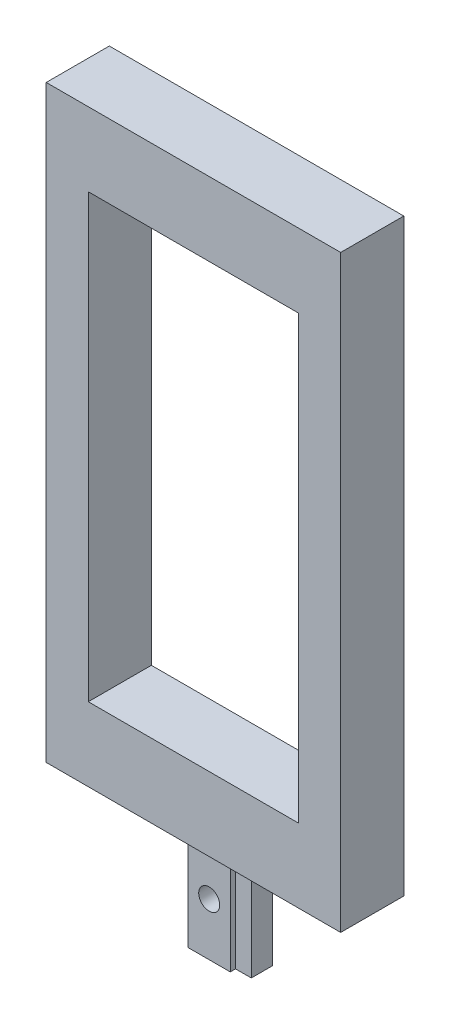
ISO-10303-21;
HEADER;
FILE_DESCRIPTION(('STEP AP214'),'2;1');
FILE_NAME('part.step','',(''),(''),'','','');
FILE_SCHEMA(('AUTOMOTIVE_DESIGN { 1 0 10303 214 1 1 1 1 }'));
ENDSEC;
DATA;
#1=APPLICATION_CONTEXT('core data for automotive mechanical design processes');
#2=APPLICATION_PROTOCOL_DEFINITION('international standard','automotive_design',2000,#1);
#3=PRODUCT_CONTEXT('',#1,'mechanical');
#4=PRODUCT('Part','Part','',(#3));
#5=PRODUCT_RELATED_PRODUCT_CATEGORY('part','',(#4));
#6=PRODUCT_DEFINITION_FORMATION('','',#4);
#7=PRODUCT_DEFINITION_CONTEXT('part definition',#1,'design');
#8=PRODUCT_DEFINITION('design','',#6,#7);
#9=PRODUCT_DEFINITION_SHAPE('','',#8);
#10=(LENGTH_UNIT() NAMED_UNIT(*) SI_UNIT(.MILLI.,.METRE.));
#11=(NAMED_UNIT(*) PLANE_ANGLE_UNIT() SI_UNIT($,.RADIAN.));
#12=(NAMED_UNIT(*) SI_UNIT($,.STERADIAN.) SOLID_ANGLE_UNIT());
#13=UNCERTAINTY_MEASURE_WITH_UNIT(LENGTH_MEASURE(1.E-05),#10,'distance_accuracy_value','');
#14=(GEOMETRIC_REPRESENTATION_CONTEXT(3) GLOBAL_UNCERTAINTY_ASSIGNED_CONTEXT((#13)) GLOBAL_UNIT_ASSIGNED_CONTEXT((#10,
#11,#12)) REPRESENTATION_CONTEXT('',''));
#15=CARTESIAN_POINT('',(0.,0.,0.));
#16=DIRECTION('',(0.,0.,1.));
#17=DIRECTION('',(1.,0.,0.));
#18=AXIS2_PLACEMENT_3D('',#15,#16,#17);
#19=CARTESIAN_POINT('',(-14.,-28.,6.));
#20=DIRECTION('',(0.,1.,0.));
#21=DIRECTION('',(0.,0.,1.));
#22=AXIS2_PLACEMENT_3D('',#19,#20,#21);
#23=PLANE('',#22);
#24=DIRECTION('',(1.,0.,0.));
#25=VECTOR('',#24,1.);
#26=CARTESIAN_POINT('',(-14.,-28.,0.));
#27=LINE('',#26,#25);
#28=CARTESIAN_POINT('',(-14.,-28.,0.));
#29=VERTEX_POINT('',#28);
#30=CARTESIAN_POINT('',(14.,-28.,0.));
#31=VERTEX_POINT('',#30);
#32=EDGE_CURVE('E235',#29,#31,#27,.T.);
#33=ORIENTED_EDGE('',*,*,#32,.T.);
#34=DIRECTION('',(0.,0.,-1.));
#35=VECTOR('',#34,1.);
#36=CARTESIAN_POINT('',(14.,-28.,6.));
#37=LINE('',#36,#35);
#38=CARTESIAN_POINT('',(14.,-28.,6.));
#39=VERTEX_POINT('',#38);
#40=EDGE_CURVE('E244',#39,#31,#37,.T.);
#41=ORIENTED_EDGE('',*,*,#40,.F.);
#42=DIRECTION('',(1.,0.,0.));
#43=VECTOR('',#42,1.);
#44=CARTESIAN_POINT('',(-14.,-28.,6.));
#45=LINE('',#44,#43);
#46=CARTESIAN_POINT('',(-14.,-28.,6.));
#47=VERTEX_POINT('',#46);
#48=EDGE_CURVE('E241',#47,#39,#45,.T.);
#49=ORIENTED_EDGE('',*,*,#48,.F.);
#50=DIRECTION('',(0.,0.,-1.));
#51=VECTOR('',#50,1.);
#52=CARTESIAN_POINT('',(-14.,-28.,6.));
#53=LINE('',#52,#51);
#54=EDGE_CURVE('E259',#47,#29,#53,.T.);
#55=ORIENTED_EDGE('',*,*,#54,.T.);
#56=EDGE_LOOP('',(#33,#41,#49,#55));
#57=FACE_BOUND('',#56,.T.);
#58=DIRECTION('',(1.,0.,0.));
#59=VECTOR('',#58,1.);
#60=CARTESIAN_POINT('',(0.,-28.,1.5));
#61=LINE('',#60,#59);
#62=CARTESIAN_POINT('',(-2.,-28.,1.5));
#63=VERTEX_POINT('',#62);
#64=CARTESIAN_POINT('',(2.,-28.,1.5));
#65=VERTEX_POINT('',#64);
#66=EDGE_CURVE('E57',#63,#65,#61,.T.);
#67=ORIENTED_EDGE('',*,*,#66,.F.);
#68=DIRECTION('',(0.,0.,1.));
#69=VECTOR('',#68,1.);
#70=CARTESIAN_POINT('',(-2.,-28.,0.));
#71=LINE('',#70,#69);
#72=CARTESIAN_POINT('',(-2.,-28.,4.5));
#73=VERTEX_POINT('',#72);
#74=EDGE_CURVE('E62',#63,#73,#71,.T.);
#75=ORIENTED_EDGE('',*,*,#74,.T.);
#76=DIRECTION('',(1.,0.,0.));
#77=VECTOR('',#76,1.);
#78=CARTESIAN_POINT('',(0.,-28.,4.5));
#79=LINE('',#78,#77);
#80=CARTESIAN_POINT('',(2.,-28.,4.5));
#81=VERTEX_POINT('',#80);
#82=EDGE_CURVE('E398',#73,#81,#79,.T.);
#83=ORIENTED_EDGE('',*,*,#82,.T.);
#84=DIRECTION('',(0.,0.,1.));
#85=VECTOR('',#84,1.);
#86=CARTESIAN_POINT('',(2.,-28.,0.));
#87=LINE('',#86,#85);
#88=CARTESIAN_POINT('',(2.,-28.,4.));
#89=VERTEX_POINT('',#88);
#90=EDGE_CURVE('E387',#89,#81,#87,.T.);
#91=ORIENTED_EDGE('',*,*,#90,.F.);
#92=DIRECTION('',(1.,0.,0.));
#93=VECTOR('',#92,1.);
#94=CARTESIAN_POINT('',(0.,-28.,4.));
#95=LINE('',#94,#93);
#96=CARTESIAN_POINT('',(3.5,-28.,4.));
#97=VERTEX_POINT('',#96);
#98=EDGE_CURVE('E395',#89,#97,#95,.T.);
#99=ORIENTED_EDGE('',*,*,#98,.T.);
#100=DIRECTION('',(0.,0.,1.));
#101=VECTOR('',#100,1.);
#102=CARTESIAN_POINT('',(3.5,-28.,0.));
#103=LINE('',#102,#101);
#104=CARTESIAN_POINT('',(3.5,-28.,2.));
#105=VERTEX_POINT('',#104);
#106=EDGE_CURVE('E391',#105,#97,#103,.T.);
#107=ORIENTED_EDGE('',*,*,#106,.F.);
#108=DIRECTION('',(1.,0.,0.));
#109=VECTOR('',#108,1.);
#110=CARTESIAN_POINT('',(0.,-28.,2.));
#111=LINE('',#110,#109);
#112=CARTESIAN_POINT('',(2.,-28.,2.));
#113=VERTEX_POINT('',#112);
#114=EDGE_CURVE('E386',#113,#105,#111,.T.);
#115=ORIENTED_EDGE('',*,*,#114,.F.);
#116=EDGE_CURVE('E364',#65,#113,#87,.T.);
#117=ORIENTED_EDGE('',*,*,#116,.F.);
#118=EDGE_LOOP('',(#67,#75,#83,#91,#99,#107,#115,#117));
#119=FACE_BOUND('',#118,.T.);
#120=ADVANCED_FACE('F41',(#57,#119),#23,.F.);
#121=CARTESIAN_POINT('',(0.,0.,6.));
#122=DIRECTION('',(0.,0.,-1.));
#123=DIRECTION('',(-1.,0.,0.));
#124=AXIS2_PLACEMENT_3D('',#121,#122,#123);
#125=PLANE('',#124);
#126=DIRECTION('',(0.,1.,0.));
#127=VECTOR('',#126,1.);
#128=CARTESIAN_POINT('',(14.,-28.,6.));
#129=LINE('',#128,#127);
#130=CARTESIAN_POINT('',(14.,28.,6.));
#131=VERTEX_POINT('',#130);
#132=EDGE_CURVE('E230',#39,#131,#129,.T.);
#133=ORIENTED_EDGE('',*,*,#132,.T.);
#134=DIRECTION('',(-1.,0.,0.));
#135=VECTOR('',#134,1.);
#136=CARTESIAN_POINT('',(-14.,28.,6.));
#137=LINE('',#136,#135);
#138=CARTESIAN_POINT('',(-14.,28.,6.));
#139=VERTEX_POINT('',#138);
#140=EDGE_CURVE('E234',#131,#139,#137,.T.);
#141=ORIENTED_EDGE('',*,*,#140,.T.);
#142=DIRECTION('',(0.,-1.,0.));
#143=VECTOR('',#142,1.);
#144=CARTESIAN_POINT('',(-14.,-28.,6.));
#145=LINE('',#144,#143);
#146=EDGE_CURVE('E238',#139,#47,#145,.T.);
#147=ORIENTED_EDGE('',*,*,#146,.T.);
#148=ORIENTED_EDGE('',*,*,#48,.T.);
#149=EDGE_LOOP('',(#133,#141,#147,#148));
#150=FACE_BOUND('',#149,.T.);
#151=DIRECTION('',(0.,1.,0.));
#152=VECTOR('',#151,1.);
#153=CARTESIAN_POINT('',(10.,-21.,6.));
#154=LINE('',#153,#152);
#155=CARTESIAN_POINT('',(10.,-21.,6.));
#156=VERTEX_POINT('',#155);
#157=CARTESIAN_POINT('',(10.,21.,6.));
#158=VERTEX_POINT('',#157);
#159=EDGE_CURVE('E191',#156,#158,#154,.T.);
#160=ORIENTED_EDGE('',*,*,#159,.F.);
#161=DIRECTION('',(1.,0.,0.));
#162=VECTOR('',#161,1.);
#163=CARTESIAN_POINT('',(-10.,-21.,6.));
#164=LINE('',#163,#162);
#165=CARTESIAN_POINT('',(-10.,-21.,6.));
#166=VERTEX_POINT('',#165);
#167=EDGE_CURVE('E202',#166,#156,#164,.T.);
#168=ORIENTED_EDGE('',*,*,#167,.F.);
#169=DIRECTION('',(0.,-1.,0.));
#170=VECTOR('',#169,1.);
#171=CARTESIAN_POINT('',(-10.,-21.,6.));
#172=LINE('',#171,#170);
#173=CARTESIAN_POINT('',(-10.,21.,6.));
#174=VERTEX_POINT('',#173);
#175=EDGE_CURVE('E198',#174,#166,#172,.T.);
#176=ORIENTED_EDGE('',*,*,#175,.F.);
#177=DIRECTION('',(-1.,0.,0.));
#178=VECTOR('',#177,1.);
#179=CARTESIAN_POINT('',(-10.,21.,6.));
#180=LINE('',#179,#178);
#181=EDGE_CURVE('E194',#158,#174,#180,.T.);
#182=ORIENTED_EDGE('',*,*,#181,.F.);
#183=EDGE_LOOP('',(#160,#168,#176,#182));
#184=FACE_BOUND('',#183,.T.);
#185=ADVANCED_FACE('F283',(#150,#184),#125,.F.);
#186=CARTESIAN_POINT('',(0.,0.,0.));
#187=DIRECTION('',(0.,0.,-1.));
#188=DIRECTION('',(-1.,0.,0.));
#189=AXIS2_PLACEMENT_3D('',#186,#187,#188);
#190=PLANE('',#189);
#191=DIRECTION('',(0.,1.,0.));
#192=VECTOR('',#191,1.);
#193=CARTESIAN_POINT('',(14.,-28.,0.));
#194=LINE('',#193,#192);
#195=CARTESIAN_POINT('',(14.,28.,0.));
#196=VERTEX_POINT('',#195);
#197=EDGE_CURVE('E229',#31,#196,#194,.T.);
#198=ORIENTED_EDGE('',*,*,#197,.F.);
#199=ORIENTED_EDGE('',*,*,#32,.F.);
#200=DIRECTION('',(0.,-1.,0.));
#201=VECTOR('',#200,1.);
#202=CARTESIAN_POINT('',(-14.,-28.,0.));
#203=LINE('',#202,#201);
#204=CARTESIAN_POINT('',(-14.,28.,0.));
#205=VERTEX_POINT('',#204);
#206=EDGE_CURVE('E251',#205,#29,#203,.T.);
#207=ORIENTED_EDGE('',*,*,#206,.F.);
#208=DIRECTION('',(-1.,0.,0.));
#209=VECTOR('',#208,1.);
#210=CARTESIAN_POINT('',(-14.,28.,0.));
#211=LINE('',#210,#209);
#212=EDGE_CURVE('E248',#196,#205,#211,.T.);
#213=ORIENTED_EDGE('',*,*,#212,.F.);
#214=EDGE_LOOP('',(#198,#199,#207,#213));
#215=FACE_BOUND('',#214,.T.);
#216=DIRECTION('',(1.,0.,0.));
#217=VECTOR('',#216,1.);
#218=CARTESIAN_POINT('',(-10.,-21.,0.));
#219=LINE('',#218,#217);
#220=CARTESIAN_POINT('',(-10.,-21.,0.));
#221=VERTEX_POINT('',#220);
#222=CARTESIAN_POINT('',(10.,-21.,0.));
#223=VERTEX_POINT('',#222);
#224=EDGE_CURVE('E195',#221,#223,#219,.T.);
#225=ORIENTED_EDGE('',*,*,#224,.T.);
#226=DIRECTION('',(0.,1.,0.));
#227=VECTOR('',#226,1.);
#228=CARTESIAN_POINT('',(10.,-21.,0.));
#229=LINE('',#228,#227);
#230=CARTESIAN_POINT('',(10.,21.,0.));
#231=VERTEX_POINT('',#230);
#232=EDGE_CURVE('E180',#223,#231,#229,.T.);
#233=ORIENTED_EDGE('',*,*,#232,.T.);
#234=DIRECTION('',(-1.,0.,0.));
#235=VECTOR('',#234,1.);
#236=CARTESIAN_POINT('',(-10.,21.,0.));
#237=LINE('',#236,#235);
#238=CARTESIAN_POINT('',(-10.,21.,0.));
#239=VERTEX_POINT('',#238);
#240=EDGE_CURVE('E185',#231,#239,#237,.T.);
#241=ORIENTED_EDGE('',*,*,#240,.T.);
#242=DIRECTION('',(0.,-1.,0.));
#243=VECTOR('',#242,1.);
#244=CARTESIAN_POINT('',(-10.,-21.,0.));
#245=LINE('',#244,#243);
#246=EDGE_CURVE('E209',#239,#221,#245,.T.);
#247=ORIENTED_EDGE('',*,*,#246,.T.);
#248=EDGE_LOOP('',(#225,#233,#241,#247));
#249=FACE_BOUND('',#248,.T.);
#250=ADVANCED_FACE('F274',(#215,#249),#190,.T.);
#251=CARTESIAN_POINT('',(14.,-28.,6.));
#252=DIRECTION('',(-1.,0.,0.));
#253=DIRECTION('',(0.,0.,1.));
#254=AXIS2_PLACEMENT_3D('',#251,#252,#253);
#255=PLANE('',#254);
#256=ORIENTED_EDGE('',*,*,#197,.T.);
#257=DIRECTION('',(0.,0.,-1.));
#258=VECTOR('',#257,1.);
#259=CARTESIAN_POINT('',(14.,28.,6.));
#260=LINE('',#259,#258);
#261=EDGE_CURVE('E11',#131,#196,#260,.T.);
#262=ORIENTED_EDGE('',*,*,#261,.F.);
#263=ORIENTED_EDGE('',*,*,#132,.F.);
#264=ORIENTED_EDGE('',*,*,#40,.T.);
#265=EDGE_LOOP('',(#256,#262,#263,#264));
#266=FACE_BOUND('',#265,.T.);
#267=ADVANCED_FACE('F43',(#266),#255,.F.);
#268=CARTESIAN_POINT('',(-14.,28.,6.));
#269=DIRECTION('',(0.,-1.,0.));
#270=DIRECTION('',(0.,0.,-1.));
#271=AXIS2_PLACEMENT_3D('',#268,#269,#270);
#272=PLANE('',#271);
#273=ORIENTED_EDGE('',*,*,#212,.T.);
#274=DIRECTION('',(0.,0.,-1.));
#275=VECTOR('',#274,1.);
#276=CARTESIAN_POINT('',(-14.,28.,6.));
#277=LINE('',#276,#275);
#278=EDGE_CURVE('E50',#139,#205,#277,.T.);
#279=ORIENTED_EDGE('',*,*,#278,.F.);
#280=ORIENTED_EDGE('',*,*,#140,.F.);
#281=ORIENTED_EDGE('',*,*,#261,.T.);
#282=EDGE_LOOP('',(#273,#279,#280,#281));
#283=FACE_BOUND('',#282,.T.);
#284=ADVANCED_FACE('F285',(#283),#272,.F.);
#285=CARTESIAN_POINT('',(-14.,-28.,6.));
#286=DIRECTION('',(1.,0.,0.));
#287=DIRECTION('',(0.,0.,-1.));
#288=AXIS2_PLACEMENT_3D('',#285,#286,#287);
#289=PLANE('',#288);
#290=ORIENTED_EDGE('',*,*,#206,.T.);
#291=ORIENTED_EDGE('',*,*,#54,.F.);
#292=ORIENTED_EDGE('',*,*,#146,.F.);
#293=ORIENTED_EDGE('',*,*,#278,.T.);
#294=EDGE_LOOP('',(#290,#291,#292,#293));
#295=FACE_BOUND('',#294,.T.);
#296=ADVANCED_FACE('F268',(#295),#289,.F.);
#297=CARTESIAN_POINT('',(10.,-21.,6.));
#298=DIRECTION('',(-1.,0.,0.));
#299=DIRECTION('',(0.,0.,1.));
#300=AXIS2_PLACEMENT_3D('',#297,#298,#299);
#301=PLANE('',#300);
#302=ORIENTED_EDGE('',*,*,#232,.F.);
#303=DIRECTION('',(0.,0.,-1.));
#304=VECTOR('',#303,1.);
#305=CARTESIAN_POINT('',(10.,-21.,6.));
#306=LINE('',#305,#304);
#307=EDGE_CURVE('E204',#156,#223,#306,.T.);
#308=ORIENTED_EDGE('',*,*,#307,.F.);
#309=ORIENTED_EDGE('',*,*,#159,.T.);
#310=DIRECTION('',(0.,0.,-1.));
#311=VECTOR('',#310,1.);
#312=CARTESIAN_POINT('',(10.,21.,6.));
#313=LINE('',#312,#311);
#314=EDGE_CURVE('E225',#158,#231,#313,.T.);
#315=ORIENTED_EDGE('',*,*,#314,.T.);
#316=EDGE_LOOP('',(#302,#308,#309,#315));
#317=FACE_BOUND('',#316,.T.);
#318=ADVANCED_FACE('F291',(#317),#301,.T.);
#319=CARTESIAN_POINT('',(-10.,21.,6.));
#320=DIRECTION('',(0.,-1.,0.));
#321=DIRECTION('',(0.,0.,-1.));
#322=AXIS2_PLACEMENT_3D('',#319,#320,#321);
#323=PLANE('',#322);
#324=ORIENTED_EDGE('',*,*,#240,.F.);
#325=ORIENTED_EDGE('',*,*,#314,.F.);
#326=ORIENTED_EDGE('',*,*,#181,.T.);
#327=DIRECTION('',(0.,0.,-1.));
#328=VECTOR('',#327,1.);
#329=CARTESIAN_POINT('',(-10.,21.,6.));
#330=LINE('',#329,#328);
#331=EDGE_CURVE('E222',#174,#239,#330,.T.);
#332=ORIENTED_EDGE('',*,*,#331,.T.);
#333=EDGE_LOOP('',(#324,#325,#326,#332));
#334=FACE_BOUND('',#333,.T.);
#335=ADVANCED_FACE('F306',(#334),#323,.T.);
#336=CARTESIAN_POINT('',(-10.,-21.,6.));
#337=DIRECTION('',(1.,0.,0.));
#338=DIRECTION('',(0.,0.,-1.));
#339=AXIS2_PLACEMENT_3D('',#336,#337,#338);
#340=PLANE('',#339);
#341=ORIENTED_EDGE('',*,*,#246,.F.);
#342=ORIENTED_EDGE('',*,*,#331,.F.);
#343=ORIENTED_EDGE('',*,*,#175,.T.);
#344=DIRECTION('',(0.,0.,-1.));
#345=VECTOR('',#344,1.);
#346=CARTESIAN_POINT('',(-10.,-21.,6.));
#347=LINE('',#346,#345);
#348=EDGE_CURVE('E219',#166,#221,#347,.T.);
#349=ORIENTED_EDGE('',*,*,#348,.T.);
#350=EDGE_LOOP('',(#341,#342,#343,#349));
#351=FACE_BOUND('',#350,.T.);
#352=ADVANCED_FACE('F310',(#351),#340,.T.);
#353=CARTESIAN_POINT('',(-10.,-21.,6.));
#354=DIRECTION('',(0.,1.,0.));
#355=DIRECTION('',(0.,0.,1.));
#356=AXIS2_PLACEMENT_3D('',#353,#354,#355);
#357=PLANE('',#356);
#358=ORIENTED_EDGE('',*,*,#224,.F.);
#359=ORIENTED_EDGE('',*,*,#348,.F.);
#360=ORIENTED_EDGE('',*,*,#167,.T.);
#361=ORIENTED_EDGE('',*,*,#307,.T.);
#362=EDGE_LOOP('',(#358,#359,#360,#361));
#363=FACE_BOUND('',#362,.T.);
#364=ADVANCED_FACE('F314',(#363),#357,.T.);
#365=CARTESIAN_POINT('',(0.,-38.,1.5));
#366=DIRECTION('',(0.,0.,1.));
#367=DIRECTION('',(1.,0.,0.));
#368=AXIS2_PLACEMENT_3D('',#365,#366,#367);
#369=PLANE('',#368);
#370=CARTESIAN_POINT('',(0.,-33.,1.5));
#371=DIRECTION('',(0.,0.,1.));
#372=DIRECTION('',(1.,0.,0.));
#373=AXIS2_PLACEMENT_3D('',#370,#371,#372);
#374=CIRCLE('',#373,1.);
#375=CARTESIAN_POINT('',(1.,-33.,1.5));
#376=VERTEX_POINT('',#375);
#377=EDGE_CURVE('E359',#376,#376,#374,.T.);
#378=ORIENTED_EDGE('',*,*,#377,.T.);
#379=EDGE_LOOP('',(#378));
#380=FACE_BOUND('',#379,.T.);
#381=ORIENTED_EDGE('',*,*,#66,.T.);
#382=DIRECTION('',(0.,1.,0.));
#383=VECTOR('',#382,1.);
#384=CARTESIAN_POINT('',(2.,-38.,1.5));
#385=LINE('',#384,#383);
#386=CARTESIAN_POINT('',(2.,-38.,1.5));
#387=VERTEX_POINT('',#386);
#388=EDGE_CURVE('E159',#387,#65,#385,.T.);
#389=ORIENTED_EDGE('',*,*,#388,.F.);
#390=DIRECTION('',(1.,0.,0.));
#391=VECTOR('',#390,1.);
#392=CARTESIAN_POINT('',(0.,-38.,1.5));
#393=LINE('',#392,#391);
#394=CARTESIAN_POINT('',(-2.,-38.,1.5));
#395=VERTEX_POINT('',#394);
#396=EDGE_CURVE('E166',#395,#387,#393,.T.);
#397=ORIENTED_EDGE('',*,*,#396,.F.);
#398=DIRECTION('',(0.,1.,0.));
#399=VECTOR('',#398,1.);
#400=CARTESIAN_POINT('',(-2.,-38.,1.5));
#401=LINE('',#400,#399);
#402=EDGE_CURVE('E382',#395,#63,#401,.T.);
#403=ORIENTED_EDGE('',*,*,#402,.T.);
#404=EDGE_LOOP('',(#381,#389,#397,#403));
#405=FACE_BOUND('',#404,.T.);
#406=ADVANCED_FACE('F178',(#380,#405),#369,.F.);
#407=CARTESIAN_POINT('',(2.,-38.,0.));
#408=DIRECTION('',(-1.,0.,0.));
#409=DIRECTION('',(0.,0.,1.));
#410=AXIS2_PLACEMENT_3D('',#407,#408,#409);
#411=PLANE('',#410);
#412=ORIENTED_EDGE('',*,*,#116,.T.);
#413=DIRECTION('',(0.,1.,0.));
#414=VECTOR('',#413,1.);
#415=CARTESIAN_POINT('',(2.,-38.,2.));
#416=LINE('',#415,#414);
#417=CARTESIAN_POINT('',(2.,-38.,2.));
#418=VERTEX_POINT('',#417);
#419=EDGE_CURVE('E161',#418,#113,#416,.T.);
#420=ORIENTED_EDGE('',*,*,#419,.F.);
#421=DIRECTION('',(0.,0.,1.));
#422=VECTOR('',#421,1.);
#423=CARTESIAN_POINT('',(2.,-38.,0.));
#424=LINE('',#423,#422);
#425=EDGE_CURVE('E154',#387,#418,#424,.T.);
#426=ORIENTED_EDGE('',*,*,#425,.F.);
#427=ORIENTED_EDGE('',*,*,#388,.T.);
#428=EDGE_LOOP('',(#412,#420,#426,#427));
#429=FACE_BOUND('',#428,.T.);
#430=ADVANCED_FACE('F157',(#429),#411,.F.);
#431=CARTESIAN_POINT('',(0.,-38.,2.));
#432=DIRECTION('',(0.,0.,1.));
#433=DIRECTION('',(1.,0.,0.));
#434=AXIS2_PLACEMENT_3D('',#431,#432,#433);
#435=PLANE('',#434);
#436=ORIENTED_EDGE('',*,*,#114,.T.);
#437=DIRECTION('',(0.,1.,0.));
#438=VECTOR('',#437,1.);
#439=CARTESIAN_POINT('',(3.5,-38.,2.));
#440=LINE('',#439,#438);
#441=CARTESIAN_POINT('',(3.5,-38.,2.));
#442=VERTEX_POINT('',#441);
#443=EDGE_CURVE('E187',#442,#105,#440,.T.);
#444=ORIENTED_EDGE('',*,*,#443,.F.);
#445=DIRECTION('',(1.,0.,0.));
#446=VECTOR('',#445,1.);
#447=CARTESIAN_POINT('',(0.,-38.,2.));
#448=LINE('',#447,#446);
#449=EDGE_CURVE('E165',#418,#442,#448,.T.);
#450=ORIENTED_EDGE('',*,*,#449,.F.);
#451=ORIENTED_EDGE('',*,*,#419,.T.);
#452=EDGE_LOOP('',(#436,#444,#450,#451));
#453=FACE_BOUND('',#452,.T.);
#454=ADVANCED_FACE('F322',(#453),#435,.F.);
#455=CARTESIAN_POINT('',(3.5,-38.,0.));
#456=DIRECTION('',(-1.,0.,0.));
#457=DIRECTION('',(0.,0.,1.));
#458=AXIS2_PLACEMENT_3D('',#455,#456,#457);
#459=PLANE('',#458);
#460=ORIENTED_EDGE('',*,*,#106,.T.);
#461=DIRECTION('',(0.,1.,0.));
#462=VECTOR('',#461,1.);
#463=CARTESIAN_POINT('',(3.5,-38.,4.));
#464=LINE('',#463,#462);
#465=CARTESIAN_POINT('',(3.5,-38.,4.));
#466=VERTEX_POINT('',#465);
#467=EDGE_CURVE('E416',#466,#97,#464,.T.);
#468=ORIENTED_EDGE('',*,*,#467,.F.);
#469=DIRECTION('',(0.,0.,1.));
#470=VECTOR('',#469,1.);
#471=CARTESIAN_POINT('',(3.5,-38.,0.));
#472=LINE('',#471,#470);
#473=EDGE_CURVE('E370',#442,#466,#472,.T.);
#474=ORIENTED_EDGE('',*,*,#473,.F.);
#475=ORIENTED_EDGE('',*,*,#443,.T.);
#476=EDGE_LOOP('',(#460,#468,#474,#475));
#477=FACE_BOUND('',#476,.T.);
#478=ADVANCED_FACE('F325',(#477),#459,.F.);
#479=CARTESIAN_POINT('',(0.,-38.,4.));
#480=DIRECTION('',(0.,0.,1.));
#481=DIRECTION('',(1.,0.,0.));
#482=AXIS2_PLACEMENT_3D('',#479,#480,#481);
#483=PLANE('',#482);
#484=ORIENTED_EDGE('',*,*,#98,.F.);
#485=DIRECTION('',(0.,1.,0.));
#486=VECTOR('',#485,1.);
#487=CARTESIAN_POINT('',(2.,-38.,4.));
#488=LINE('',#487,#486);
#489=CARTESIAN_POINT('',(2.,-38.,4.));
#490=VERTEX_POINT('',#489);
#491=EDGE_CURVE('E412',#490,#89,#488,.T.);
#492=ORIENTED_EDGE('',*,*,#491,.F.);
#493=DIRECTION('',(1.,0.,0.));
#494=VECTOR('',#493,1.);
#495=CARTESIAN_POINT('',(0.,-38.,4.));
#496=LINE('',#495,#494);
#497=EDGE_CURVE('E373',#490,#466,#496,.T.);
#498=ORIENTED_EDGE('',*,*,#497,.T.);
#499=ORIENTED_EDGE('',*,*,#467,.T.);
#500=EDGE_LOOP('',(#484,#492,#498,#499));
#501=FACE_BOUND('',#500,.T.);
#502=ADVANCED_FACE('F329',(#501),#483,.T.);
#503=ORIENTED_EDGE('',*,*,#90,.T.);
#504=DIRECTION('',(0.,1.,0.));
#505=VECTOR('',#504,1.);
#506=CARTESIAN_POINT('',(2.,-38.,4.5));
#507=LINE('',#506,#505);
#508=CARTESIAN_POINT('',(2.,-38.,4.5));
#509=VERTEX_POINT('',#508);
#510=EDGE_CURVE('E408',#509,#81,#507,.T.);
#511=ORIENTED_EDGE('',*,*,#510,.F.);
#512=EDGE_CURVE('E168',#490,#509,#424,.T.);
#513=ORIENTED_EDGE('',*,*,#512,.F.);
#514=ORIENTED_EDGE('',*,*,#491,.T.);
#515=EDGE_LOOP('',(#503,#511,#513,#514));
#516=FACE_BOUND('',#515,.T.);
#517=ADVANCED_FACE('F333',(#516),#411,.F.);
#518=CARTESIAN_POINT('',(0.,-38.,4.5));
#519=DIRECTION('',(0.,0.,1.));
#520=DIRECTION('',(1.,0.,0.));
#521=AXIS2_PLACEMENT_3D('',#518,#519,#520);
#522=PLANE('',#521);
#523=CARTESIAN_POINT('',(0.,-33.,4.5));
#524=DIRECTION('',(0.,0.,1.));
#525=DIRECTION('',(1.,0.,0.));
#526=AXIS2_PLACEMENT_3D('',#523,#524,#525);
#527=CIRCLE('',#526,1.);
#528=CARTESIAN_POINT('',(1.,-33.,4.5));
#529=VERTEX_POINT('',#528);
#530=EDGE_CURVE('E356',#529,#529,#527,.T.);
#531=ORIENTED_EDGE('',*,*,#530,.F.);
#532=EDGE_LOOP('',(#531));
#533=FACE_BOUND('',#532,.T.);
#534=ORIENTED_EDGE('',*,*,#82,.F.);
#535=DIRECTION('',(0.,1.,0.));
#536=VECTOR('',#535,1.);
#537=CARTESIAN_POINT('',(-2.,-38.,4.5));
#538=LINE('',#537,#536);
#539=CARTESIAN_POINT('',(-2.,-38.,4.5));
#540=VERTEX_POINT('',#539);
#541=EDGE_CURVE('E405',#540,#73,#538,.T.);
#542=ORIENTED_EDGE('',*,*,#541,.F.);
#543=DIRECTION('',(1.,0.,0.));
#544=VECTOR('',#543,1.);
#545=CARTESIAN_POINT('',(0.,-38.,4.5));
#546=LINE('',#545,#544);
#547=EDGE_CURVE('E377',#540,#509,#546,.T.);
#548=ORIENTED_EDGE('',*,*,#547,.T.);
#549=ORIENTED_EDGE('',*,*,#510,.T.);
#550=EDGE_LOOP('',(#534,#542,#548,#549));
#551=FACE_BOUND('',#550,.T.);
#552=ADVANCED_FACE('F337',(#533,#551),#522,.T.);
#553=CARTESIAN_POINT('',(-2.,-38.,0.));
#554=DIRECTION('',(-1.,0.,0.));
#555=DIRECTION('',(0.,0.,1.));
#556=AXIS2_PLACEMENT_3D('',#553,#554,#555);
#557=PLANE('',#556);
#558=ORIENTED_EDGE('',*,*,#74,.F.);
#559=ORIENTED_EDGE('',*,*,#402,.F.);
#560=DIRECTION('',(0.,0.,1.));
#561=VECTOR('',#560,1.);
#562=CARTESIAN_POINT('',(-2.,-38.,0.));
#563=LINE('',#562,#561);
#564=EDGE_CURVE('E174',#395,#540,#563,.T.);
#565=ORIENTED_EDGE('',*,*,#564,.T.);
#566=ORIENTED_EDGE('',*,*,#541,.T.);
#567=EDGE_LOOP('',(#558,#559,#565,#566));
#568=FACE_BOUND('',#567,.T.);
#569=ADVANCED_FACE('F341',(#568),#557,.T.);
#570=CARTESIAN_POINT('',(0.,-38.,0.));
#571=DIRECTION('',(0.,-1.,0.));
#572=DIRECTION('',(0.,0.,-1.));
#573=AXIS2_PLACEMENT_3D('',#570,#571,#572);
#574=PLANE('',#573);
#575=ORIENTED_EDGE('',*,*,#396,.T.);
#576=ORIENTED_EDGE('',*,*,#425,.T.);
#577=ORIENTED_EDGE('',*,*,#449,.T.);
#578=ORIENTED_EDGE('',*,*,#473,.T.);
#579=ORIENTED_EDGE('',*,*,#497,.F.);
#580=ORIENTED_EDGE('',*,*,#512,.T.);
#581=ORIENTED_EDGE('',*,*,#547,.F.);
#582=ORIENTED_EDGE('',*,*,#564,.F.);
#583=EDGE_LOOP('',(#575,#576,#577,#578,#579,#580,#581,#582));
#584=FACE_BOUND('',#583,.T.);
#585=ADVANCED_FACE('F171',(#584),#574,.T.);
#586=CARTESIAN_POINT('',(0.,-33.,-5.5));
#587=DIRECTION('',(0.,0.,1.));
#588=DIRECTION('',(1.,0.,0.));
#589=AXIS2_PLACEMENT_3D('',#586,#587,#588);
#590=CYLINDRICAL_SURFACE('',#589,1.);
#591=ORIENTED_EDGE('',*,*,#530,.T.);
#592=EDGE_LOOP('',(#591));
#593=FACE_BOUND('',#592,.T.);
#594=ORIENTED_EDGE('',*,*,#377,.F.);
#595=EDGE_LOOP('',(#594));
#596=FACE_BOUND('',#595,.T.);
#597=ADVANCED_FACE('F348',(#593,#596),#590,.F.);
#598=CLOSED_SHELL('',(#120,#185,#250,#267,#284,#296,#318,#335,#352,#364,#406,#430,#454,#478,
#502,#517,#552,#569,#585,#597));
#599=MANIFOLD_SOLID_BREP('B2',#598);
#600=ADVANCED_BREP_SHAPE_REPRESENTATION('',(#18,#599),#14);
#601=SHAPE_DEFINITION_REPRESENTATION(#9,#600);
ENDSEC;
END-ISO-10303-21;
